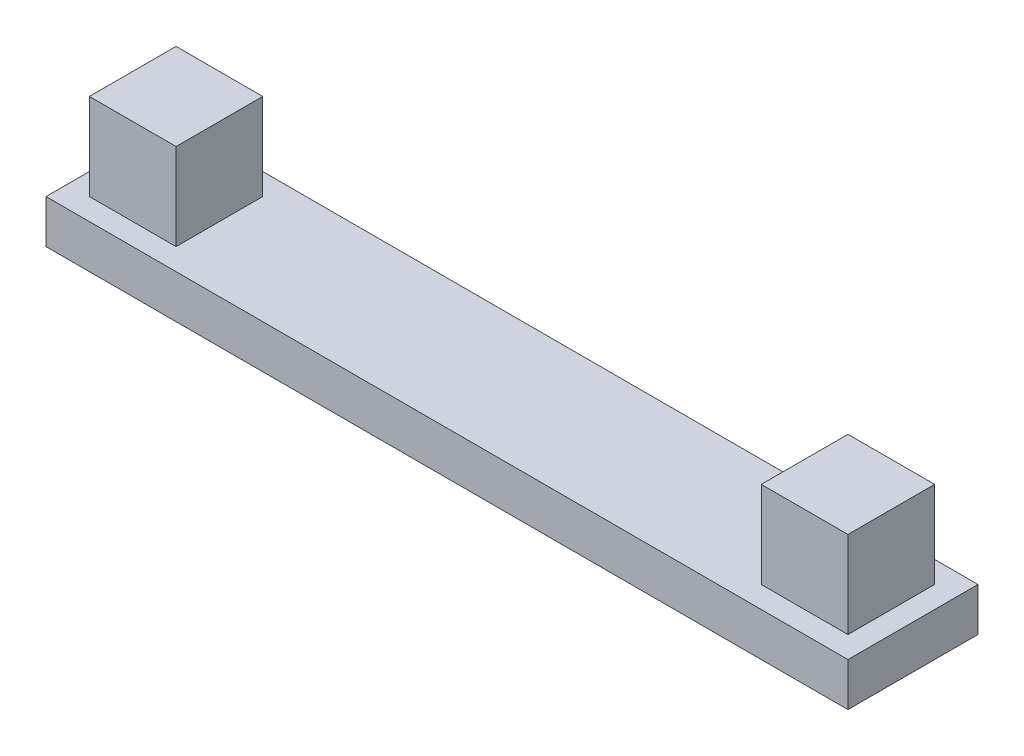
ISO-10303-21;
HEADER;
FILE_DESCRIPTION(('STEP AP214'),'2;1');
FILE_NAME('part.step','',(''),(''),'','','');
FILE_SCHEMA(('AUTOMOTIVE_DESIGN { 1 0 10303 214 1 1 1 1 }'));
ENDSEC;
DATA;
#1=APPLICATION_CONTEXT('core data for automotive mechanical design processes');
#2=APPLICATION_PROTOCOL_DEFINITION('international standard','automotive_design',2000,#1);
#3=PRODUCT_CONTEXT('',#1,'mechanical');
#4=PRODUCT('Part','Part','',(#3));
#5=PRODUCT_RELATED_PRODUCT_CATEGORY('part','',(#4));
#6=PRODUCT_DEFINITION_FORMATION('','',#4);
#7=PRODUCT_DEFINITION_CONTEXT('part definition',#1,'design');
#8=PRODUCT_DEFINITION('design','',#6,#7);
#9=PRODUCT_DEFINITION_SHAPE('','',#8);
#10=(LENGTH_UNIT() NAMED_UNIT(*) SI_UNIT(.MILLI.,.METRE.));
#11=(NAMED_UNIT(*) PLANE_ANGLE_UNIT() SI_UNIT($,.RADIAN.));
#12=(NAMED_UNIT(*) SI_UNIT($,.STERADIAN.) SOLID_ANGLE_UNIT());
#13=UNCERTAINTY_MEASURE_WITH_UNIT(LENGTH_MEASURE(1.E-05),#10,'distance_accuracy_value','');
#14=(GEOMETRIC_REPRESENTATION_CONTEXT(3) GLOBAL_UNCERTAINTY_ASSIGNED_CONTEXT((#13)) GLOBAL_UNIT_ASSIGNED_CONTEXT((#10,
#11,#12)) REPRESENTATION_CONTEXT('',''));
#15=CARTESIAN_POINT('',(0.,0.,0.));
#16=DIRECTION('',(0.,0.,1.));
#17=DIRECTION('',(1.,0.,0.));
#18=AXIS2_PLACEMENT_3D('',#15,#16,#17);
#19=CARTESIAN_POINT('',(0.,1.,0.));
#20=DIRECTION('',(0.,0.,-1.));
#21=DIRECTION('',(-1.,0.,0.));
#22=AXIS2_PLACEMENT_3D('',#19,#20,#21);
#23=PLANE('',#22);
#24=DIRECTION('',(1.,0.,0.));
#25=VECTOR('',#24,1.);
#26=CARTESIAN_POINT('',(0.,0.,0.));
#27=LINE('',#26,#25);
#28=CARTESIAN_POINT('',(0.,0.,0.));
#29=VERTEX_POINT('',#28);
#30=CARTESIAN_POINT('',(18.5,0.,0.));
#31=VERTEX_POINT('',#30);
#32=EDGE_CURVE('E134',#29,#31,#27,.T.);
#33=ORIENTED_EDGE('',*,*,#32,.T.);
#34=DIRECTION('',(0.,-1.,0.));
#35=VECTOR('',#34,1.);
#36=CARTESIAN_POINT('',(18.5,1.,0.));
#37=LINE('',#36,#35);
#38=CARTESIAN_POINT('',(18.5,1.,0.));
#39=VERTEX_POINT('',#38);
#40=EDGE_CURVE('E11',#39,#31,#37,.T.);
#41=ORIENTED_EDGE('',*,*,#40,.F.);
#42=DIRECTION('',(1.,0.,0.));
#43=VECTOR('',#42,1.);
#44=CARTESIAN_POINT('',(0.,1.,0.));
#45=LINE('',#44,#43);
#46=CARTESIAN_POINT('',(0.,1.,0.));
#47=VERTEX_POINT('',#46);
#48=EDGE_CURVE('E99',#47,#39,#45,.T.);
#49=ORIENTED_EDGE('',*,*,#48,.F.);
#50=DIRECTION('',(0.,-1.,0.));
#51=VECTOR('',#50,1.);
#52=CARTESIAN_POINT('',(0.,1.,0.));
#53=LINE('',#52,#51);
#54=EDGE_CURVE('E76',#47,#29,#53,.T.);
#55=ORIENTED_EDGE('',*,*,#54,.T.);
#56=EDGE_LOOP('',(#33,#41,#49,#55));
#57=FACE_BOUND('',#56,.T.);
#58=ADVANCED_FACE('F33',(#57),#23,.F.);
#59=CARTESIAN_POINT('',(18.5,1.,0.));
#60=DIRECTION('',(-1.,0.,0.));
#61=DIRECTION('',(0.,0.,1.));
#62=AXIS2_PLACEMENT_3D('',#59,#60,#61);
#63=PLANE('',#62);
#64=DIRECTION('',(0.,0.,-1.));
#65=VECTOR('',#64,1.);
#66=CARTESIAN_POINT('',(18.5,0.,0.));
#67=LINE('',#66,#65);
#68=CARTESIAN_POINT('',(18.5,0.,-3.));
#69=VERTEX_POINT('',#68);
#70=EDGE_CURVE('E136',#31,#69,#67,.T.);
#71=ORIENTED_EDGE('',*,*,#70,.T.);
#72=DIRECTION('',(0.,-1.,0.));
#73=VECTOR('',#72,1.);
#74=CARTESIAN_POINT('',(18.5,1.,-3.));
#75=LINE('',#74,#73);
#76=CARTESIAN_POINT('',(18.5,1.,-3.));
#77=VERTEX_POINT('',#76);
#78=EDGE_CURVE('E41',#77,#69,#75,.T.);
#79=ORIENTED_EDGE('',*,*,#78,.F.);
#80=DIRECTION('',(0.,0.,-1.));
#81=VECTOR('',#80,1.);
#82=CARTESIAN_POINT('',(18.5,1.,0.));
#83=LINE('',#82,#81);
#84=EDGE_CURVE('E84',#39,#77,#83,.T.);
#85=ORIENTED_EDGE('',*,*,#84,.F.);
#86=ORIENTED_EDGE('',*,*,#40,.T.);
#87=EDGE_LOOP('',(#71,#79,#85,#86));
#88=FACE_BOUND('',#87,.T.);
#89=ADVANCED_FACE('F146',(#88),#63,.F.);
#90=CARTESIAN_POINT('',(0.,1.,-3.));
#91=DIRECTION('',(0.,0.,-1.));
#92=DIRECTION('',(-1.,0.,0.));
#93=AXIS2_PLACEMENT_3D('',#90,#91,#92);
#94=PLANE('',#93);
#95=DIRECTION('',(1.,0.,0.));
#96=VECTOR('',#95,1.);
#97=CARTESIAN_POINT('',(0.,0.,-3.));
#98=LINE('',#97,#96);
#99=CARTESIAN_POINT('',(0.,0.,-3.));
#100=VERTEX_POINT('',#99);
#101=EDGE_CURVE('E140',#100,#69,#98,.T.);
#102=ORIENTED_EDGE('',*,*,#101,.F.);
#103=DIRECTION('',(0.,-1.,0.));
#104=VECTOR('',#103,1.);
#105=CARTESIAN_POINT('',(0.,1.,-3.));
#106=LINE('',#105,#104);
#107=CARTESIAN_POINT('',(0.,1.,-3.));
#108=VERTEX_POINT('',#107);
#109=EDGE_CURVE('E68',#108,#100,#106,.T.);
#110=ORIENTED_EDGE('',*,*,#109,.F.);
#111=DIRECTION('',(1.,0.,0.));
#112=VECTOR('',#111,1.);
#113=CARTESIAN_POINT('',(0.,1.,-3.));
#114=LINE('',#113,#112);
#115=EDGE_CURVE('E106',#108,#77,#114,.T.);
#116=ORIENTED_EDGE('',*,*,#115,.T.);
#117=ORIENTED_EDGE('',*,*,#78,.T.);
#118=EDGE_LOOP('',(#102,#110,#116,#117));
#119=FACE_BOUND('',#118,.T.);
#120=ADVANCED_FACE('F145',(#119),#94,.T.);
#121=CARTESIAN_POINT('',(0.,1.,0.));
#122=DIRECTION('',(-1.,0.,0.));
#123=DIRECTION('',(0.,0.,1.));
#124=AXIS2_PLACEMENT_3D('',#121,#122,#123);
#125=PLANE('',#124);
#126=DIRECTION('',(0.,0.,-1.));
#127=VECTOR('',#126,1.);
#128=CARTESIAN_POINT('',(0.,0.,0.));
#129=LINE('',#128,#127);
#130=EDGE_CURVE('E95',#29,#100,#129,.T.);
#131=ORIENTED_EDGE('',*,*,#130,.F.);
#132=ORIENTED_EDGE('',*,*,#54,.F.);
#133=DIRECTION('',(0.,0.,-1.));
#134=VECTOR('',#133,1.);
#135=CARTESIAN_POINT('',(0.,1.,0.));
#136=LINE('',#135,#134);
#137=EDGE_CURVE('E93',#47,#108,#136,.T.);
#138=ORIENTED_EDGE('',*,*,#137,.T.);
#139=ORIENTED_EDGE('',*,*,#109,.T.);
#140=EDGE_LOOP('',(#131,#132,#138,#139));
#141=FACE_BOUND('',#140,.T.);
#142=ADVANCED_FACE('F91',(#141),#125,.T.);
#143=CARTESIAN_POINT('',(0.,1.,0.));
#144=DIRECTION('',(0.,1.,0.));
#145=DIRECTION('',(0.,0.,1.));
#146=AXIS2_PLACEMENT_3D('',#143,#144,#145);
#147=PLANE('',#146);
#148=ORIENTED_EDGE('',*,*,#48,.T.);
#149=ORIENTED_EDGE('',*,*,#84,.T.);
#150=ORIENTED_EDGE('',*,*,#115,.F.);
#151=ORIENTED_EDGE('',*,*,#137,.F.);
#152=EDGE_LOOP('',(#148,#149,#150,#151));
#153=FACE_BOUND('',#152,.T.);
#154=DIRECTION('',(1.,0.,0.));
#155=VECTOR('',#154,1.);
#156=CARTESIAN_POINT('',(0.,1.,-2.5));
#157=LINE('',#156,#155);
#158=CARTESIAN_POINT('',(0.500000000000002,1.,-2.5));
#159=VERTEX_POINT('',#158);
#160=CARTESIAN_POINT('',(2.5,1.,-2.5));
#161=VERTEX_POINT('',#160);
#162=EDGE_CURVE('E107',#159,#161,#157,.T.);
#163=ORIENTED_EDGE('',*,*,#162,.T.);
#164=DIRECTION('',(0.,0.,1.));
#165=VECTOR('',#164,1.);
#166=CARTESIAN_POINT('',(2.5,1.,0.));
#167=LINE('',#166,#165);
#168=CARTESIAN_POINT('',(2.5,1.,-0.5));
#169=VERTEX_POINT('',#168);
#170=EDGE_CURVE('E110',#161,#169,#167,.T.);
#171=ORIENTED_EDGE('',*,*,#170,.T.);
#172=DIRECTION('',(1.,0.,0.));
#173=VECTOR('',#172,1.);
#174=CARTESIAN_POINT('',(0.,1.,-0.5));
#175=LINE('',#174,#173);
#176=CARTESIAN_POINT('',(0.500000000000002,1.,-0.5));
#177=VERTEX_POINT('',#176);
#178=EDGE_CURVE('E117',#177,#169,#175,.T.);
#179=ORIENTED_EDGE('',*,*,#178,.F.);
#180=DIRECTION('',(0.,0.,1.));
#181=VECTOR('',#180,1.);
#182=CARTESIAN_POINT('',(0.500000000000002,1.,0.));
#183=LINE('',#182,#181);
#184=EDGE_CURVE('E120',#159,#177,#183,.T.);
#185=ORIENTED_EDGE('',*,*,#184,.F.);
#186=EDGE_LOOP('',(#163,#171,#179,#185));
#187=FACE_BOUND('',#186,.T.);
#188=DIRECTION('',(1.,0.,0.));
#189=VECTOR('',#188,1.);
#190=CARTESIAN_POINT('',(0.,1.,-2.49999999999999));
#191=LINE('',#190,#189);
#192=CARTESIAN_POINT('',(16.,1.,-2.5));
#193=VERTEX_POINT('',#192);
#194=CARTESIAN_POINT('',(18.,1.,-2.5));
#195=VERTEX_POINT('',#194);
#196=EDGE_CURVE('E123',#193,#195,#191,.T.);
#197=ORIENTED_EDGE('',*,*,#196,.T.);
#198=DIRECTION('',(0.,0.,1.));
#199=VECTOR('',#198,1.);
#200=CARTESIAN_POINT('',(18.,1.,0.));
#201=LINE('',#200,#199);
#202=CARTESIAN_POINT('',(18.,1.,-0.5));
#203=VERTEX_POINT('',#202);
#204=EDGE_CURVE('E126',#195,#203,#201,.T.);
#205=ORIENTED_EDGE('',*,*,#204,.T.);
#206=DIRECTION('',(1.,0.,0.));
#207=VECTOR('',#206,1.);
#208=CARTESIAN_POINT('',(0.,1.,-0.5));
#209=LINE('',#208,#207);
#210=CARTESIAN_POINT('',(16.,1.,-0.5));
#211=VERTEX_POINT('',#210);
#212=EDGE_CURVE('E129',#211,#203,#209,.T.);
#213=ORIENTED_EDGE('',*,*,#212,.F.);
#214=DIRECTION('',(0.,0.,1.));
#215=VECTOR('',#214,1.);
#216=CARTESIAN_POINT('',(16.,1.,0.));
#217=LINE('',#216,#215);
#218=EDGE_CURVE('E96',#193,#211,#217,.T.);
#219=ORIENTED_EDGE('',*,*,#218,.F.);
#220=EDGE_LOOP('',(#197,#205,#213,#219));
#221=FACE_BOUND('',#220,.T.);
#222=ADVANCED_FACE('F103',(#153,#187,#221),#147,.T.);
#223=CARTESIAN_POINT('',(0.,0.,0.));
#224=DIRECTION('',(0.,1.,0.));
#225=DIRECTION('',(0.,0.,1.));
#226=AXIS2_PLACEMENT_3D('',#223,#224,#225);
#227=PLANE('',#226);
#228=ORIENTED_EDGE('',*,*,#32,.F.);
#229=ORIENTED_EDGE('',*,*,#130,.T.);
#230=ORIENTED_EDGE('',*,*,#101,.T.);
#231=ORIENTED_EDGE('',*,*,#70,.F.);
#232=EDGE_LOOP('',(#228,#229,#230,#231));
#233=FACE_BOUND('',#232,.T.);
#234=ADVANCED_FACE('F148',(#233),#227,.F.);
#235=CARTESIAN_POINT('',(0.500000000000002,3.,-2.5));
#236=DIRECTION('',(1.,0.,0.));
#237=DIRECTION('',(0.,0.,-1.));
#238=AXIS2_PLACEMENT_3D('',#235,#236,#237);
#239=PLANE('',#238);
#240=ORIENTED_EDGE('',*,*,#184,.T.);
#241=DIRECTION('',(0.,-1.,0.));
#242=VECTOR('',#241,1.);
#243=CARTESIAN_POINT('',(0.500000000000002,3.,-0.5));
#244=LINE('',#243,#242);
#245=CARTESIAN_POINT('',(0.500000000000002,3.,-0.5));
#246=VERTEX_POINT('',#245);
#247=EDGE_CURVE('E137',#246,#177,#244,.T.);
#248=ORIENTED_EDGE('',*,*,#247,.F.);
#249=DIRECTION('',(0.,0.,1.));
#250=VECTOR('',#249,1.);
#251=CARTESIAN_POINT('',(0.500000000000002,3.,-2.5));
#252=LINE('',#251,#250);
#253=CARTESIAN_POINT('',(0.500000000000002,3.,-2.5));
#254=VERTEX_POINT('',#253);
#255=EDGE_CURVE('E299',#254,#246,#252,.T.);
#256=ORIENTED_EDGE('',*,*,#255,.F.);
#257=DIRECTION('',(0.,-1.,0.));
#258=VECTOR('',#257,1.);
#259=CARTESIAN_POINT('',(0.500000000000002,3.,-2.5));
#260=LINE('',#259,#258);
#261=EDGE_CURVE('E330',#254,#159,#260,.T.);
#262=ORIENTED_EDGE('',*,*,#261,.T.);
#263=EDGE_LOOP('',(#240,#248,#256,#262));
#264=FACE_BOUND('',#263,.T.);
#265=ADVANCED_FACE('F150',(#264),#239,.F.);
#266=CARTESIAN_POINT('',(0.500000000000002,3.,-0.5));
#267=DIRECTION('',(0.,0.,-1.));
#268=DIRECTION('',(-1.,0.,0.));
#269=AXIS2_PLACEMENT_3D('',#266,#267,#268);
#270=PLANE('',#269);
#271=ORIENTED_EDGE('',*,*,#178,.T.);
#272=DIRECTION('',(0.,-1.,0.));
#273=VECTOR('',#272,1.);
#274=CARTESIAN_POINT('',(2.5,3.,-0.5));
#275=LINE('',#274,#273);
#276=CARTESIAN_POINT('',(2.5,3.,-0.5));
#277=VERTEX_POINT('',#276);
#278=EDGE_CURVE('E335',#277,#169,#275,.T.);
#279=ORIENTED_EDGE('',*,*,#278,.F.);
#280=DIRECTION('',(1.,0.,0.));
#281=VECTOR('',#280,1.);
#282=CARTESIAN_POINT('',(0.500000000000002,3.,-0.5));
#283=LINE('',#282,#281);
#284=EDGE_CURVE('E321',#246,#277,#283,.T.);
#285=ORIENTED_EDGE('',*,*,#284,.F.);
#286=ORIENTED_EDGE('',*,*,#247,.T.);
#287=EDGE_LOOP('',(#271,#279,#285,#286));
#288=FACE_BOUND('',#287,.T.);
#289=ADVANCED_FACE('F156',(#288),#270,.F.);
#290=CARTESIAN_POINT('',(2.5,3.,-2.5));
#291=DIRECTION('',(1.,0.,0.));
#292=DIRECTION('',(0.,0.,-1.));
#293=AXIS2_PLACEMENT_3D('',#290,#291,#292);
#294=PLANE('',#293);
#295=ORIENTED_EDGE('',*,*,#278,.T.);
#296=ORIENTED_EDGE('',*,*,#170,.F.);
#297=DIRECTION('',(0.,-1.,0.));
#298=VECTOR('',#297,1.);
#299=CARTESIAN_POINT('',(2.5,3.,-2.5));
#300=LINE('',#299,#298);
#301=CARTESIAN_POINT('',(2.5,3.,-2.5));
#302=VERTEX_POINT('',#301);
#303=EDGE_CURVE('E333',#302,#161,#300,.T.);
#304=ORIENTED_EDGE('',*,*,#303,.F.);
#305=DIRECTION('',(0.,0.,1.));
#306=VECTOR('',#305,1.);
#307=CARTESIAN_POINT('',(2.5,3.,-2.5));
#308=LINE('',#307,#306);
#309=EDGE_CURVE('E324',#302,#277,#308,.T.);
#310=ORIENTED_EDGE('',*,*,#309,.T.);
#311=EDGE_LOOP('',(#295,#296,#304,#310));
#312=FACE_BOUND('',#311,.T.);
#313=ADVANCED_FACE('F199',(#312),#294,.T.);
#314=CARTESIAN_POINT('',(0.500000000000002,3.,-2.5));
#315=DIRECTION('',(0.,0.,-1.));
#316=DIRECTION('',(-1.,0.,0.));
#317=AXIS2_PLACEMENT_3D('',#314,#315,#316);
#318=PLANE('',#317);
#319=ORIENTED_EDGE('',*,*,#303,.T.);
#320=ORIENTED_EDGE('',*,*,#162,.F.);
#321=ORIENTED_EDGE('',*,*,#261,.F.);
#322=DIRECTION('',(1.,0.,0.));
#323=VECTOR('',#322,1.);
#324=CARTESIAN_POINT('',(0.500000000000002,3.,-2.5));
#325=LINE('',#324,#323);
#326=EDGE_CURVE('E327',#254,#302,#325,.T.);
#327=ORIENTED_EDGE('',*,*,#326,.T.);
#328=EDGE_LOOP('',(#319,#320,#321,#327));
#329=FACE_BOUND('',#328,.T.);
#330=ADVANCED_FACE('F209',(#329),#318,.T.);
#331=CARTESIAN_POINT('',(0.,3.,0.));
#332=DIRECTION('',(0.,1.,0.));
#333=DIRECTION('',(0.,0.,1.));
#334=AXIS2_PLACEMENT_3D('',#331,#332,#333);
#335=PLANE('',#334);
#336=ORIENTED_EDGE('',*,*,#255,.T.);
#337=ORIENTED_EDGE('',*,*,#284,.T.);
#338=ORIENTED_EDGE('',*,*,#309,.F.);
#339=ORIENTED_EDGE('',*,*,#326,.F.);
#340=EDGE_LOOP('',(#336,#337,#338,#339));
#341=FACE_BOUND('',#340,.T.);
#342=ADVANCED_FACE('F219',(#341),#335,.T.);
#343=CARTESIAN_POINT('',(16.,3.,-2.5));
#344=DIRECTION('',(1.,0.,0.));
#345=DIRECTION('',(0.,0.,-1.));
#346=AXIS2_PLACEMENT_3D('',#343,#344,#345);
#347=PLANE('',#346);
#348=ORIENTED_EDGE('',*,*,#218,.T.);
#349=DIRECTION('',(0.,-1.,0.));
#350=VECTOR('',#349,1.);
#351=CARTESIAN_POINT('',(16.,3.,-0.5));
#352=LINE('',#351,#350);
#353=CARTESIAN_POINT('',(16.,3.,-0.5));
#354=VERTEX_POINT('',#353);
#355=EDGE_CURVE('E302',#354,#211,#352,.T.);
#356=ORIENTED_EDGE('',*,*,#355,.F.);
#357=DIRECTION('',(0.,0.,1.));
#358=VECTOR('',#357,1.);
#359=CARTESIAN_POINT('',(16.,3.,-2.5));
#360=LINE('',#359,#358);
#361=CARTESIAN_POINT('',(16.,3.,-2.5));
#362=VERTEX_POINT('',#361);
#363=EDGE_CURVE('E287',#362,#354,#360,.T.);
#364=ORIENTED_EDGE('',*,*,#363,.F.);
#365=DIRECTION('',(0.,-1.,0.));
#366=VECTOR('',#365,1.);
#367=CARTESIAN_POINT('',(16.,3.,-2.5));
#368=LINE('',#367,#366);
#369=EDGE_CURVE('E312',#362,#193,#368,.T.);
#370=ORIENTED_EDGE('',*,*,#369,.T.);
#371=EDGE_LOOP('',(#348,#356,#364,#370));
#372=FACE_BOUND('',#371,.T.);
#373=ADVANCED_FACE('F229',(#372),#347,.F.);
#374=CARTESIAN_POINT('',(16.,3.,-0.5));
#375=DIRECTION('',(0.,0.,-1.));
#376=DIRECTION('',(-1.,0.,0.));
#377=AXIS2_PLACEMENT_3D('',#374,#375,#376);
#378=PLANE('',#377);
#379=ORIENTED_EDGE('',*,*,#212,.T.);
#380=DIRECTION('',(0.,-1.,0.));
#381=VECTOR('',#380,1.);
#382=CARTESIAN_POINT('',(18.,3.,-0.5));
#383=LINE('',#382,#381);
#384=CARTESIAN_POINT('',(18.,3.,-0.5));
#385=VERTEX_POINT('',#384);
#386=EDGE_CURVE('E306',#385,#203,#383,.T.);
#387=ORIENTED_EDGE('',*,*,#386,.F.);
#388=DIRECTION('',(1.,0.,0.));
#389=VECTOR('',#388,1.);
#390=CARTESIAN_POINT('',(16.,3.,-0.5));
#391=LINE('',#390,#389);
#392=EDGE_CURVE('E292',#354,#385,#391,.T.);
#393=ORIENTED_EDGE('',*,*,#392,.F.);
#394=ORIENTED_EDGE('',*,*,#355,.T.);
#395=EDGE_LOOP('',(#379,#387,#393,#394));
#396=FACE_BOUND('',#395,.T.);
#397=ADVANCED_FACE('F239',(#396),#378,.F.);
#398=CARTESIAN_POINT('',(18.,3.,-2.5));
#399=DIRECTION('',(1.,0.,0.));
#400=DIRECTION('',(0.,0.,-1.));
#401=AXIS2_PLACEMENT_3D('',#398,#399,#400);
#402=PLANE('',#401);
#403=ORIENTED_EDGE('',*,*,#386,.T.);
#404=ORIENTED_EDGE('',*,*,#204,.F.);
#405=DIRECTION('',(0.,-1.,0.));
#406=VECTOR('',#405,1.);
#407=CARTESIAN_POINT('',(18.,3.,-2.5));
#408=LINE('',#407,#406);
#409=CARTESIAN_POINT('',(18.,3.,-2.5));
#410=VERTEX_POINT('',#409);
#411=EDGE_CURVE('E49',#410,#195,#408,.T.);
#412=ORIENTED_EDGE('',*,*,#411,.F.);
#413=DIRECTION('',(0.,0.,1.));
#414=VECTOR('',#413,1.);
#415=CARTESIAN_POINT('',(18.,3.,-2.5));
#416=LINE('',#415,#414);
#417=EDGE_CURVE('E315',#410,#385,#416,.T.);
#418=ORIENTED_EDGE('',*,*,#417,.T.);
#419=EDGE_LOOP('',(#403,#404,#412,#418));
#420=FACE_BOUND('',#419,.T.);
#421=ADVANCED_FACE('F249',(#420),#402,.T.);
#422=CARTESIAN_POINT('',(16.,3.,-2.5));
#423=DIRECTION('',(0.,0.,-1.));
#424=DIRECTION('',(-1.,0.,0.));
#425=AXIS2_PLACEMENT_3D('',#422,#423,#424);
#426=PLANE('',#425);
#427=ORIENTED_EDGE('',*,*,#411,.T.);
#428=ORIENTED_EDGE('',*,*,#196,.F.);
#429=ORIENTED_EDGE('',*,*,#369,.F.);
#430=DIRECTION('',(1.,0.,0.));
#431=VECTOR('',#430,1.);
#432=CARTESIAN_POINT('',(16.,3.,-2.5));
#433=LINE('',#432,#431);
#434=EDGE_CURVE('E295',#362,#410,#433,.T.);
#435=ORIENTED_EDGE('',*,*,#434,.T.);
#436=EDGE_LOOP('',(#427,#428,#429,#435));
#437=FACE_BOUND('',#436,.T.);
#438=ADVANCED_FACE('F259',(#437),#426,.T.);
#439=CARTESIAN_POINT('',(0.,3.,0.));
#440=DIRECTION('',(0.,1.,0.));
#441=DIRECTION('',(0.,0.,1.));
#442=AXIS2_PLACEMENT_3D('',#439,#440,#441);
#443=PLANE('',#442);
#444=ORIENTED_EDGE('',*,*,#363,.T.);
#445=ORIENTED_EDGE('',*,*,#392,.T.);
#446=ORIENTED_EDGE('',*,*,#417,.F.);
#447=ORIENTED_EDGE('',*,*,#434,.F.);
#448=EDGE_LOOP('',(#444,#445,#446,#447));
#449=FACE_BOUND('',#448,.T.);
#450=ADVANCED_FACE('F269',(#449),#443,.T.);
#451=CLOSED_SHELL('',(#58,#89,#120,#142,#222,#234,#265,#289,#313,#330,#342,#373,#397,#421,#438,#450));
#452=MANIFOLD_SOLID_BREP('B2',#451);
#453=ADVANCED_BREP_SHAPE_REPRESENTATION('',(#18,#452),#14);
#454=SHAPE_DEFINITION_REPRESENTATION(#9,#453);
ENDSEC;
END-ISO-10303-21;
